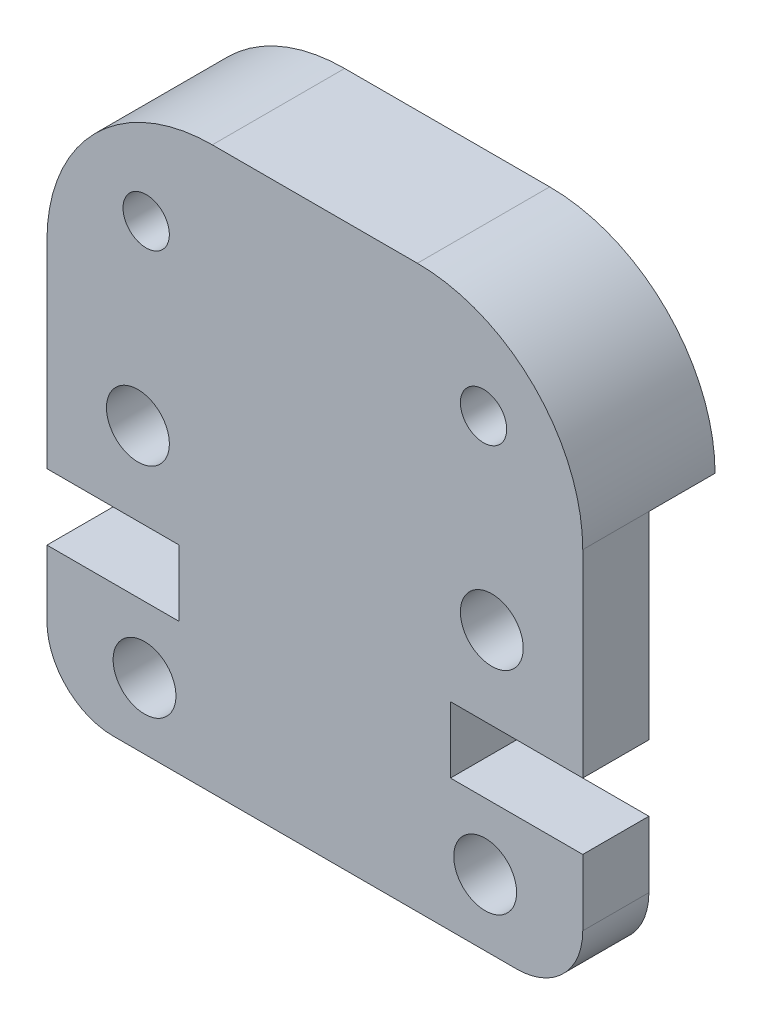
ISO-10303-21;
HEADER;
FILE_DESCRIPTION(('STEP AP214'),'2;1');
FILE_NAME('part.step','',(''),(''),'','','');
FILE_SCHEMA(('AUTOMOTIVE_DESIGN { 1 0 10303 214 1 1 1 1 }'));
ENDSEC;
DATA;
#1=APPLICATION_CONTEXT('core data for automotive mechanical design processes');
#2=APPLICATION_PROTOCOL_DEFINITION('international standard','automotive_design',2000,#1);
#3=PRODUCT_CONTEXT('',#1,'mechanical');
#4=PRODUCT('Part','Part','',(#3));
#5=PRODUCT_RELATED_PRODUCT_CATEGORY('part','',(#4));
#6=PRODUCT_DEFINITION_FORMATION('','',#4);
#7=PRODUCT_DEFINITION_CONTEXT('part definition',#1,'design');
#8=PRODUCT_DEFINITION('design','',#6,#7);
#9=PRODUCT_DEFINITION_SHAPE('','',#8);
#10=(LENGTH_UNIT() NAMED_UNIT(*) SI_UNIT(.MILLI.,.METRE.));
#11=(NAMED_UNIT(*) PLANE_ANGLE_UNIT() SI_UNIT($,.RADIAN.));
#12=(NAMED_UNIT(*) SI_UNIT($,.STERADIAN.) SOLID_ANGLE_UNIT());
#13=UNCERTAINTY_MEASURE_WITH_UNIT(LENGTH_MEASURE(1.E-05),#10,'distance_accuracy_value','');
#14=(GEOMETRIC_REPRESENTATION_CONTEXT(3) GLOBAL_UNCERTAINTY_ASSIGNED_CONTEXT((#13)) GLOBAL_UNIT_ASSIGNED_CONTEXT((#10,
#11,#12)) REPRESENTATION_CONTEXT('',''));
#15=CARTESIAN_POINT('',(0.,0.,0.));
#16=DIRECTION('',(0.,0.,1.));
#17=DIRECTION('',(1.,0.,0.));
#18=AXIS2_PLACEMENT_3D('',#15,#16,#17);
#19=CARTESIAN_POINT('',(-3.09999999999862,11.9799999999986,0.));
#20=DIRECTION('',(0.,0.,-1.));
#21=DIRECTION('',(-1.,0.,0.));
#22=AXIS2_PLACEMENT_3D('',#19,#20,#21);
#23=PLANE('',#22);
#24=CARTESIAN_POINT('',(-5.09999999999842,13.9799999999999,0.));
#25=DIRECTION('',(0.,0.,1.));
#26=DIRECTION('',(-1.,0.,0.));
#27=AXIS2_PLACEMENT_3D('',#24,#25,#26);
#28=CIRCLE('',#27,0.7);
#29=CARTESIAN_POINT('',(-5.79999999999843,13.9799999999999,0.));
#30=VERTEX_POINT('',#29);
#31=EDGE_CURVE('E275',#30,#30,#28,.T.);
#32=ORIENTED_EDGE('',*,*,#31,.T.);
#33=EDGE_LOOP('',(#32));
#34=FACE_BOUND('',#33,.T.);
#35=CARTESIAN_POINT('',(5.09999999999843,13.9799999999999,0.));
#36=DIRECTION('',(0.,0.,1.));
#37=DIRECTION('',(1.,0.,0.));
#38=AXIS2_PLACEMENT_3D('',#35,#36,#37);
#39=CIRCLE('',#38,0.699999999999999);
#40=CARTESIAN_POINT('',(5.79999999999843,13.9799999999999,0.));
#41=VERTEX_POINT('',#40);
#42=EDGE_CURVE('E263',#41,#41,#39,.T.);
#43=ORIENTED_EDGE('',*,*,#42,.T.);
#44=EDGE_LOOP('',(#43));
#45=FACE_BOUND('',#44,.T.);
#46=CARTESIAN_POINT('',(3.09999999999862,11.9799999999986,0.));
#47=DIRECTION('',(0.,0.,1.));
#48=DIRECTION('',(1.,0.,0.));
#49=AXIS2_PLACEMENT_3D('',#46,#47,#48);
#50=CIRCLE('',#49,5.00000000000135);
#51=CARTESIAN_POINT('',(8.09999999999997,11.9799999999986,0.));
#52=VERTEX_POINT('',#51);
#53=CARTESIAN_POINT('',(3.09999999999862,16.98,0.));
#54=VERTEX_POINT('',#53);
#55=EDGE_CURVE('E67',#52,#54,#50,.T.);
#56=ORIENTED_EDGE('',*,*,#55,.F.);
#57=DIRECTION('',(-1.,0.,0.));
#58=VECTOR('',#57,1.);
#59=CARTESIAN_POINT('',(8.09999999999997,11.9799999999986,0.));
#60=LINE('',#59,#58);
#61=CARTESIAN_POINT('',(-8.09999999999997,11.9799999999986,0.));
#62=VERTEX_POINT('',#61);
#63=EDGE_CURVE('E215',#52,#62,#60,.T.);
#64=ORIENTED_EDGE('',*,*,#63,.T.);
#65=CARTESIAN_POINT('',(-3.09999999999862,11.9799999999986,0.));
#66=DIRECTION('',(0.,0.,1.));
#67=DIRECTION('',(-1.,0.,0.));
#68=AXIS2_PLACEMENT_3D('',#65,#66,#67);
#69=CIRCLE('',#68,5.00000000000136);
#70=CARTESIAN_POINT('',(-3.09999999999862,16.98,0.));
#71=VERTEX_POINT('',#70);
#72=EDGE_CURVE('E148',#71,#62,#69,.T.);
#73=ORIENTED_EDGE('',*,*,#72,.F.);
#74=DIRECTION('',(-1.,0.,0.));
#75=VECTOR('',#74,1.);
#76=CARTESIAN_POINT('',(3.09999999999862,16.98,0.));
#77=LINE('',#76,#75);
#78=EDGE_CURVE('E73',#54,#71,#77,.T.);
#79=ORIENTED_EDGE('',*,*,#78,.F.);
#80=EDGE_LOOP('',(#56,#64,#73,#79));
#81=FACE_BOUND('',#80,.T.);
#82=ADVANCED_FACE('F34',(#34,#45,#81),#23,.T.);
#83=CARTESIAN_POINT('',(-3.09999999999862,11.9799999999986,4.));
#84=DIRECTION('',(0.,0.,-1.));
#85=DIRECTION('',(-1.,0.,0.));
#86=AXIS2_PLACEMENT_3D('',#83,#84,#85);
#87=PLANE('',#86);
#88=CARTESIAN_POINT('',(-3.09999999999862,11.9799999999986,4.));
#89=DIRECTION('',(0.,0.,1.));
#90=DIRECTION('',(-1.,0.,0.));
#91=AXIS2_PLACEMENT_3D('',#88,#89,#90);
#92=CIRCLE('',#91,5.00000000000136);
#93=CARTESIAN_POINT('',(-3.09999999999862,16.98,4.));
#94=VERTEX_POINT('',#93);
#95=CARTESIAN_POINT('',(-8.09999999999997,11.9799999999986,4.));
#96=VERTEX_POINT('',#95);
#97=EDGE_CURVE('E154',#94,#96,#92,.T.);
#98=ORIENTED_EDGE('',*,*,#97,.T.);
#99=DIRECTION('',(0.,-1.,0.));
#100=VECTOR('',#99,1.);
#101=CARTESIAN_POINT('',(-8.09999999999997,11.9799999999986,4.));
#102=LINE('',#101,#100);
#103=CARTESIAN_POINT('',(-8.09999999999997,5.99999999999993,4.));
#104=VERTEX_POINT('',#103);
#105=EDGE_CURVE('E81',#96,#104,#102,.T.);
#106=ORIENTED_EDGE('',*,*,#105,.T.);
#107=DIRECTION('',(1.,0.,0.));
#108=VECTOR('',#107,1.);
#109=CARTESIAN_POINT('',(-8.09999999999997,5.99999999999993,4.));
#110=LINE('',#109,#108);
#111=CARTESIAN_POINT('',(-4.10000000000002,5.99999999999993,4.));
#112=VERTEX_POINT('',#111);
#113=EDGE_CURVE('E197',#104,#112,#110,.T.);
#114=ORIENTED_EDGE('',*,*,#113,.T.);
#115=DIRECTION('',(0.,-1.,0.));
#116=VECTOR('',#115,1.);
#117=CARTESIAN_POINT('',(-4.10000000000002,5.99999999999993,4.));
#118=LINE('',#117,#116);
#119=CARTESIAN_POINT('',(-4.10000000000002,3.99999999999995,4.));
#120=VERTEX_POINT('',#119);
#121=EDGE_CURVE('E286',#112,#120,#118,.T.);
#122=ORIENTED_EDGE('',*,*,#121,.T.);
#123=DIRECTION('',(-1.,0.,0.));
#124=VECTOR('',#123,1.);
#125=CARTESIAN_POINT('',(-4.10000000000002,3.99999999999995,4.));
#126=LINE('',#125,#124);
#127=CARTESIAN_POINT('',(-8.09999999999997,3.99999999999995,4.));
#128=VERTEX_POINT('',#127);
#129=EDGE_CURVE('E288',#120,#128,#126,.T.);
#130=ORIENTED_EDGE('',*,*,#129,.T.);
#131=DIRECTION('',(0.,-1.,0.));
#132=VECTOR('',#131,1.);
#133=CARTESIAN_POINT('',(-8.09999999999997,1.99999999999997,4.));
#134=LINE('',#133,#132);
#135=CARTESIAN_POINT('',(-8.09999999999997,1.99999999999997,4.));
#136=VERTEX_POINT('',#135);
#137=EDGE_CURVE('E290',#128,#136,#134,.T.);
#138=ORIENTED_EDGE('',*,*,#137,.T.);
#139=CARTESIAN_POINT('',(-6.1,1.99999999999997,4.));
#140=DIRECTION('',(0.,0.,1.));
#141=DIRECTION('',(-1.,0.,0.));
#142=AXIS2_PLACEMENT_3D('',#139,#140,#141);
#143=CIRCLE('',#142,1.99999999999998);
#144=CARTESIAN_POINT('',(-6.09999999999999,0.,4.));
#145=VERTEX_POINT('',#144);
#146=EDGE_CURVE('E292',#136,#145,#143,.T.);
#147=ORIENTED_EDGE('',*,*,#146,.T.);
#148=DIRECTION('',(1.,0.,0.));
#149=VECTOR('',#148,1.);
#150=CARTESIAN_POINT('',(6.1,0.,4.));
#151=LINE('',#150,#149);
#152=CARTESIAN_POINT('',(6.1,0.,4.));
#153=VERTEX_POINT('',#152);
#154=EDGE_CURVE('E294',#145,#153,#151,.T.);
#155=ORIENTED_EDGE('',*,*,#154,.T.);
#156=CARTESIAN_POINT('',(6.1,1.99999999999998,4.));
#157=DIRECTION('',(0.,0.,1.));
#158=DIRECTION('',(1.,0.,0.));
#159=AXIS2_PLACEMENT_3D('',#156,#157,#158);
#160=CIRCLE('',#159,1.99999999999998);
#161=CARTESIAN_POINT('',(8.09999999999997,1.99999999999998,4.));
#162=VERTEX_POINT('',#161);
#163=EDGE_CURVE('E296',#153,#162,#160,.T.);
#164=ORIENTED_EDGE('',*,*,#163,.T.);
#165=DIRECTION('',(0.,1.,0.));
#166=VECTOR('',#165,1.);
#167=CARTESIAN_POINT('',(8.09999999999997,1.99999999999998,4.));
#168=LINE('',#167,#166);
#169=CARTESIAN_POINT('',(8.09999999999997,3.99999999999995,4.));
#170=VERTEX_POINT('',#169);
#171=EDGE_CURVE('E298',#162,#170,#168,.T.);
#172=ORIENTED_EDGE('',*,*,#171,.T.);
#173=DIRECTION('',(-1.,0.,0.));
#174=VECTOR('',#173,1.);
#175=CARTESIAN_POINT('',(4.10000000000002,3.99999999999995,4.));
#176=LINE('',#175,#174);
#177=CARTESIAN_POINT('',(4.10000000000002,3.99999999999995,4.));
#178=VERTEX_POINT('',#177);
#179=EDGE_CURVE('E300',#170,#178,#176,.T.);
#180=ORIENTED_EDGE('',*,*,#179,.T.);
#181=DIRECTION('',(0.,1.,0.));
#182=VECTOR('',#181,1.);
#183=CARTESIAN_POINT('',(4.10000000000002,5.99999999999993,4.));
#184=LINE('',#183,#182);
#185=CARTESIAN_POINT('',(4.10000000000002,5.99999999999993,4.));
#186=VERTEX_POINT('',#185);
#187=EDGE_CURVE('E302',#178,#186,#184,.T.);
#188=ORIENTED_EDGE('',*,*,#187,.T.);
#189=DIRECTION('',(1.,0.,0.));
#190=VECTOR('',#189,1.);
#191=CARTESIAN_POINT('',(8.09999999999997,5.99999999999993,4.));
#192=LINE('',#191,#190);
#193=CARTESIAN_POINT('',(8.09999999999997,5.99999999999993,4.));
#194=VERTEX_POINT('',#193);
#195=EDGE_CURVE('E127',#186,#194,#192,.T.);
#196=ORIENTED_EDGE('',*,*,#195,.T.);
#197=DIRECTION('',(0.,1.,0.));
#198=VECTOR('',#197,1.);
#199=CARTESIAN_POINT('',(8.09999999999997,11.9799999999986,4.));
#200=LINE('',#199,#198);
#201=CARTESIAN_POINT('',(8.09999999999997,11.9799999999986,4.));
#202=VERTEX_POINT('',#201);
#203=EDGE_CURVE('E120',#194,#202,#200,.T.);
#204=ORIENTED_EDGE('',*,*,#203,.T.);
#205=CARTESIAN_POINT('',(3.09999999999862,11.9799999999986,4.));
#206=DIRECTION('',(0.,0.,1.));
#207=DIRECTION('',(1.,0.,0.));
#208=AXIS2_PLACEMENT_3D('',#205,#206,#207);
#209=CIRCLE('',#208,5.00000000000135);
#210=CARTESIAN_POINT('',(3.09999999999862,16.98,4.));
#211=VERTEX_POINT('',#210);
#212=EDGE_CURVE('E125',#202,#211,#209,.T.);
#213=ORIENTED_EDGE('',*,*,#212,.T.);
#214=DIRECTION('',(-1.,0.,0.));
#215=VECTOR('',#214,1.);
#216=CARTESIAN_POINT('',(3.09999999999862,16.98,4.));
#217=LINE('',#216,#215);
#218=EDGE_CURVE('E52',#211,#94,#217,.T.);
#219=ORIENTED_EDGE('',*,*,#218,.T.);
#220=EDGE_LOOP('',(#98,#106,#114,#122,#130,#138,#147,#155,#164,#172,#180,#188,#196,#204,#213,#219));
#221=FACE_BOUND('',#220,.T.);
#222=CARTESIAN_POINT('',(-5.15,1.99999999999997,4.));
#223=DIRECTION('',(0.,0.,1.));
#224=DIRECTION('',(-1.,0.,0.));
#225=AXIS2_PLACEMENT_3D('',#222,#223,#224);
#226=CIRCLE('',#225,0.95);
#227=CARTESIAN_POINT('',(-6.1,1.99999999999997,4.));
#228=VERTEX_POINT('',#227);
#229=EDGE_CURVE('E151',#228,#228,#226,.T.);
#230=ORIENTED_EDGE('',*,*,#229,.F.);
#231=EDGE_LOOP('',(#230));
#232=FACE_BOUND('',#231,.T.);
#233=CARTESIAN_POINT('',(-5.09999999999842,13.9799999999999,4.));
#234=DIRECTION('',(0.,0.,1.));
#235=DIRECTION('',(-1.,0.,0.));
#236=AXIS2_PLACEMENT_3D('',#233,#234,#235);
#237=CIRCLE('',#236,0.7);
#238=CARTESIAN_POINT('',(-5.79999999999843,13.9799999999999,4.));
#239=VERTEX_POINT('',#238);
#240=EDGE_CURVE('E276',#239,#239,#237,.T.);
#241=ORIENTED_EDGE('',*,*,#240,.F.);
#242=EDGE_LOOP('',(#241));
#243=FACE_BOUND('',#242,.T.);
#244=CARTESIAN_POINT('',(-5.34999999999997,8.50000000000221,4.));
#245=DIRECTION('',(0.,0.,1.));
#246=DIRECTION('',(-1.,0.,0.));
#247=AXIS2_PLACEMENT_3D('',#244,#245,#246);
#248=CIRCLE('',#247,0.95);
#249=CARTESIAN_POINT('',(-6.29999999999997,8.50000000000221,4.));
#250=VERTEX_POINT('',#249);
#251=EDGE_CURVE('E272',#250,#250,#248,.T.);
#252=ORIENTED_EDGE('',*,*,#251,.F.);
#253=EDGE_LOOP('',(#252));
#254=FACE_BOUND('',#253,.T.);
#255=CARTESIAN_POINT('',(5.34999999999998,8.50000000000221,4.));
#256=DIRECTION('',(0.,0.,1.));
#257=DIRECTION('',(1.,0.,0.));
#258=AXIS2_PLACEMENT_3D('',#255,#256,#257);
#259=CIRCLE('',#258,0.95);
#260=CARTESIAN_POINT('',(6.29999999999998,8.50000000000221,4.));
#261=VERTEX_POINT('',#260);
#262=EDGE_CURVE('E267',#261,#261,#259,.T.);
#263=ORIENTED_EDGE('',*,*,#262,.F.);
#264=EDGE_LOOP('',(#263));
#265=FACE_BOUND('',#264,.T.);
#266=CARTESIAN_POINT('',(5.09999999999843,13.9799999999999,4.));
#267=DIRECTION('',(0.,0.,1.));
#268=DIRECTION('',(1.,0.,0.));
#269=AXIS2_PLACEMENT_3D('',#266,#267,#268);
#270=CIRCLE('',#269,0.699999999999999);
#271=CARTESIAN_POINT('',(5.79999999999843,13.9799999999999,4.));
#272=VERTEX_POINT('',#271);
#273=EDGE_CURVE('E264',#272,#272,#270,.T.);
#274=ORIENTED_EDGE('',*,*,#273,.F.);
#275=EDGE_LOOP('',(#274));
#276=FACE_BOUND('',#275,.T.);
#277=CARTESIAN_POINT('',(5.15,1.99999999999998,4.));
#278=DIRECTION('',(0.,0.,1.));
#279=DIRECTION('',(1.,0.,0.));
#280=AXIS2_PLACEMENT_3D('',#277,#278,#279);
#281=CIRCLE('',#280,0.95);
#282=CARTESIAN_POINT('',(6.1,1.99999999999998,4.));
#283=VERTEX_POINT('',#282);
#284=EDGE_CURVE('E260',#283,#283,#281,.T.);
#285=ORIENTED_EDGE('',*,*,#284,.F.);
#286=EDGE_LOOP('',(#285));
#287=FACE_BOUND('',#286,.T.);
#288=ADVANCED_FACE('F122',(#221,#232,#243,#254,#265,#276,#287),#87,.F.);
#289=CARTESIAN_POINT('',(-3.09999999999862,11.9799999999986,4.));
#290=DIRECTION('',(0.,0.,-1.));
#291=DIRECTION('',(-1.,0.,0.));
#292=AXIS2_PLACEMENT_3D('',#289,#290,#291);
#293=CYLINDRICAL_SURFACE('',#292,5.00000000000136);
#294=ORIENTED_EDGE('',*,*,#72,.T.);
#295=DIRECTION('',(0.,0.,-1.));
#296=VECTOR('',#295,1.);
#297=CARTESIAN_POINT('',(-8.09999999999997,11.9799999999986,2.));
#298=LINE('',#297,#296);
#299=CARTESIAN_POINT('',(-8.09999999999997,11.9799999999986,2.));
#300=VERTEX_POINT('',#299);
#301=EDGE_CURVE('E222',#300,#62,#298,.T.);
#302=ORIENTED_EDGE('',*,*,#301,.F.);
#303=DIRECTION('',(0.,0.,-1.));
#304=VECTOR('',#303,1.);
#305=CARTESIAN_POINT('',(-8.09999999999997,11.9799999999986,4.));
#306=LINE('',#305,#304);
#307=EDGE_CURVE('E11',#96,#300,#306,.T.);
#308=ORIENTED_EDGE('',*,*,#307,.F.);
#309=ORIENTED_EDGE('',*,*,#97,.F.);
#310=DIRECTION('',(0.,0.,-1.));
#311=VECTOR('',#310,1.);
#312=CARTESIAN_POINT('',(-3.09999999999862,16.98,4.));
#313=LINE('',#312,#311);
#314=EDGE_CURVE('E144',#94,#71,#313,.T.);
#315=ORIENTED_EDGE('',*,*,#314,.T.);
#316=EDGE_LOOP('',(#294,#302,#308,#309,#315));
#317=FACE_BOUND('',#316,.T.);
#318=ADVANCED_FACE('F36',(#317),#293,.T.);
#319=CARTESIAN_POINT('',(-8.09999999999997,11.9799999999986,4.));
#320=DIRECTION('',(1.,0.,0.));
#321=DIRECTION('',(0.,1.,0.));
#322=AXIS2_PLACEMENT_3D('',#319,#320,#321);
#323=PLANE('',#322);
#324=ORIENTED_EDGE('',*,*,#307,.T.);
#325=DIRECTION('',(0.,-1.,0.));
#326=VECTOR('',#325,1.);
#327=CARTESIAN_POINT('',(-8.09999999999997,11.9799999999986,2.));
#328=LINE('',#327,#326);
#329=CARTESIAN_POINT('',(-8.09999999999997,5.99999999999993,2.));
#330=VERTEX_POINT('',#329);
#331=EDGE_CURVE('E204',#300,#330,#328,.T.);
#332=ORIENTED_EDGE('',*,*,#331,.T.);
#333=DIRECTION('',(0.,0.,-1.));
#334=VECTOR('',#333,1.);
#335=CARTESIAN_POINT('',(-8.09999999999997,5.99999999999993,4.));
#336=LINE('',#335,#334);
#337=EDGE_CURVE('E44',#104,#330,#336,.T.);
#338=ORIENTED_EDGE('',*,*,#337,.F.);
#339=ORIENTED_EDGE('',*,*,#105,.F.);
#340=EDGE_LOOP('',(#324,#332,#338,#339));
#341=FACE_BOUND('',#340,.T.);
#342=ADVANCED_FACE('F202',(#341),#323,.F.);
#343=CARTESIAN_POINT('',(-8.09999999999997,5.99999999999993,4.));
#344=DIRECTION('',(0.,1.,0.));
#345=DIRECTION('',(-1.,0.,0.));
#346=AXIS2_PLACEMENT_3D('',#343,#344,#345);
#347=PLANE('',#346);
#348=ORIENTED_EDGE('',*,*,#337,.T.);
#349=DIRECTION('',(1.,0.,0.));
#350=VECTOR('',#349,1.);
#351=CARTESIAN_POINT('',(-8.09999999999997,5.99999999999993,2.));
#352=LINE('',#351,#350);
#353=CARTESIAN_POINT('',(-4.10000000000002,5.99999999999993,2.));
#354=VERTEX_POINT('',#353);
#355=EDGE_CURVE('E196',#330,#354,#352,.T.);
#356=ORIENTED_EDGE('',*,*,#355,.T.);
#357=DIRECTION('',(0.,0.,-1.));
#358=VECTOR('',#357,1.);
#359=CARTESIAN_POINT('',(-4.10000000000002,5.99999999999993,4.));
#360=LINE('',#359,#358);
#361=EDGE_CURVE('E185',#112,#354,#360,.T.);
#362=ORIENTED_EDGE('',*,*,#361,.F.);
#363=ORIENTED_EDGE('',*,*,#113,.F.);
#364=EDGE_LOOP('',(#348,#356,#362,#363));
#365=FACE_BOUND('',#364,.T.);
#366=ADVANCED_FACE('F193',(#365),#347,.F.);
#367=CARTESIAN_POINT('',(-4.10000000000002,5.99999999999993,4.));
#368=DIRECTION('',(1.,0.,0.));
#369=DIRECTION('',(0.,0.,-1.));
#370=AXIS2_PLACEMENT_3D('',#367,#368,#369);
#371=PLANE('',#370);
#372=ORIENTED_EDGE('',*,*,#361,.T.);
#373=DIRECTION('',(0.,-1.,0.));
#374=VECTOR('',#373,1.);
#375=CARTESIAN_POINT('',(-4.10000000000002,5.99999999999993,2.));
#376=LINE('',#375,#374);
#377=CARTESIAN_POINT('',(-4.10000000000002,3.99999999999995,2.));
#378=VERTEX_POINT('',#377);
#379=EDGE_CURVE('E256',#354,#378,#376,.T.);
#380=ORIENTED_EDGE('',*,*,#379,.T.);
#381=DIRECTION('',(0.,0.,-1.));
#382=VECTOR('',#381,1.);
#383=CARTESIAN_POINT('',(-4.10000000000002,3.99999999999995,4.));
#384=LINE('',#383,#382);
#385=EDGE_CURVE('E182',#120,#378,#384,.T.);
#386=ORIENTED_EDGE('',*,*,#385,.F.);
#387=ORIENTED_EDGE('',*,*,#121,.F.);
#388=EDGE_LOOP('',(#372,#380,#386,#387));
#389=FACE_BOUND('',#388,.T.);
#390=ADVANCED_FACE('F331',(#389),#371,.F.);
#391=CARTESIAN_POINT('',(-4.10000000000002,3.99999999999995,4.));
#392=DIRECTION('',(0.,-1.,0.));
#393=DIRECTION('',(1.,0.,0.));
#394=AXIS2_PLACEMENT_3D('',#391,#392,#393);
#395=PLANE('',#394);
#396=ORIENTED_EDGE('',*,*,#385,.T.);
#397=DIRECTION('',(-1.,0.,0.));
#398=VECTOR('',#397,1.);
#399=CARTESIAN_POINT('',(-4.10000000000002,3.99999999999995,2.));
#400=LINE('',#399,#398);
#401=CARTESIAN_POINT('',(-8.09999999999997,3.99999999999995,2.));
#402=VERTEX_POINT('',#401);
#403=EDGE_CURVE('E253',#378,#402,#400,.T.);
#404=ORIENTED_EDGE('',*,*,#403,.T.);
#405=DIRECTION('',(0.,0.,-1.));
#406=VECTOR('',#405,1.);
#407=CARTESIAN_POINT('',(-8.09999999999997,3.99999999999995,4.));
#408=LINE('',#407,#406);
#409=EDGE_CURVE('E179',#128,#402,#408,.T.);
#410=ORIENTED_EDGE('',*,*,#409,.F.);
#411=ORIENTED_EDGE('',*,*,#129,.F.);
#412=EDGE_LOOP('',(#396,#404,#410,#411));
#413=FACE_BOUND('',#412,.T.);
#414=ADVANCED_FACE('F335',(#413),#395,.F.);
#415=CARTESIAN_POINT('',(-8.09999999999997,1.99999999999997,4.));
#416=DIRECTION('',(1.,0.,0.));
#417=DIRECTION('',(0.,0.,-1.));
#418=AXIS2_PLACEMENT_3D('',#415,#416,#417);
#419=PLANE('',#418);
#420=ORIENTED_EDGE('',*,*,#409,.T.);
#421=CARTESIAN_POINT('',(-8.09999999999997,1.99999999999997,2.));
#422=VERTEX_POINT('',#421);
#423=EDGE_CURVE('E210',#402,#422,#328,.T.);
#424=ORIENTED_EDGE('',*,*,#423,.T.);
#425=DIRECTION('',(0.,0.,-1.));
#426=VECTOR('',#425,1.);
#427=CARTESIAN_POINT('',(-8.09999999999997,1.99999999999997,4.));
#428=LINE('',#427,#426);
#429=EDGE_CURVE('E176',#136,#422,#428,.T.);
#430=ORIENTED_EDGE('',*,*,#429,.F.);
#431=ORIENTED_EDGE('',*,*,#137,.F.);
#432=EDGE_LOOP('',(#420,#424,#430,#431));
#433=FACE_BOUND('',#432,.T.);
#434=ADVANCED_FACE('F390',(#433),#419,.F.);
#435=CARTESIAN_POINT('',(-6.1,1.99999999999997,4.));
#436=DIRECTION('',(0.,0.,-1.));
#437=DIRECTION('',(-1.,0.,0.));
#438=AXIS2_PLACEMENT_3D('',#435,#436,#437);
#439=CYLINDRICAL_SURFACE('',#438,1.99999999999998);
#440=ORIENTED_EDGE('',*,*,#429,.T.);
#441=CARTESIAN_POINT('',(-6.1,1.99999999999997,2.));
#442=DIRECTION('',(0.,0.,1.));
#443=DIRECTION('',(1.,0.,0.));
#444=AXIS2_PLACEMENT_3D('',#441,#442,#443);
#445=CIRCLE('',#444,1.99999999999998);
#446=CARTESIAN_POINT('',(-6.09999999999999,0.,2.));
#447=VERTEX_POINT('',#446);
#448=EDGE_CURVE('E250',#422,#447,#445,.T.);
#449=ORIENTED_EDGE('',*,*,#448,.T.);
#450=DIRECTION('',(0.,0.,-1.));
#451=VECTOR('',#450,1.);
#452=CARTESIAN_POINT('',(-6.09999999999999,0.,4.));
#453=LINE('',#452,#451);
#454=EDGE_CURVE('E173',#145,#447,#453,.T.);
#455=ORIENTED_EDGE('',*,*,#454,.F.);
#456=ORIENTED_EDGE('',*,*,#146,.F.);
#457=EDGE_LOOP('',(#440,#449,#455,#456));
#458=FACE_BOUND('',#457,.T.);
#459=ADVANCED_FACE('F386',(#458),#439,.T.);
#460=CARTESIAN_POINT('',(6.1,0.,4.));
#461=DIRECTION('',(0.,1.,0.));
#462=DIRECTION('',(-1.,0.,0.));
#463=AXIS2_PLACEMENT_3D('',#460,#461,#462);
#464=PLANE('',#463);
#465=ORIENTED_EDGE('',*,*,#454,.T.);
#466=DIRECTION('',(1.,0.,0.));
#467=VECTOR('',#466,1.);
#468=CARTESIAN_POINT('',(-8.09999999999997,0.,2.));
#469=LINE('',#468,#467);
#470=CARTESIAN_POINT('',(6.1,0.,2.));
#471=VERTEX_POINT('',#470);
#472=EDGE_CURVE('E209',#447,#471,#469,.T.);
#473=ORIENTED_EDGE('',*,*,#472,.T.);
#474=DIRECTION('',(0.,0.,-1.));
#475=VECTOR('',#474,1.);
#476=CARTESIAN_POINT('',(6.1,0.,4.));
#477=LINE('',#476,#475);
#478=EDGE_CURVE('E170',#153,#471,#477,.T.);
#479=ORIENTED_EDGE('',*,*,#478,.F.);
#480=ORIENTED_EDGE('',*,*,#154,.F.);
#481=EDGE_LOOP('',(#465,#473,#479,#480));
#482=FACE_BOUND('',#481,.T.);
#483=ADVANCED_FACE('F382',(#482),#464,.F.);
#484=CARTESIAN_POINT('',(6.1,1.99999999999998,4.));
#485=DIRECTION('',(0.,0.,-1.));
#486=DIRECTION('',(-1.,0.,0.));
#487=AXIS2_PLACEMENT_3D('',#484,#485,#486);
#488=CYLINDRICAL_SURFACE('',#487,1.99999999999998);
#489=ORIENTED_EDGE('',*,*,#478,.T.);
#490=CARTESIAN_POINT('',(6.1,1.99999999999998,2.));
#491=DIRECTION('',(0.,0.,1.));
#492=DIRECTION('',(1.,0.,0.));
#493=AXIS2_PLACEMENT_3D('',#490,#491,#492);
#494=CIRCLE('',#493,1.99999999999998);
#495=CARTESIAN_POINT('',(8.09999999999997,1.99999999999998,2.));
#496=VERTEX_POINT('',#495);
#497=EDGE_CURVE('E247',#471,#496,#494,.T.);
#498=ORIENTED_EDGE('',*,*,#497,.T.);
#499=DIRECTION('',(0.,0.,-1.));
#500=VECTOR('',#499,1.);
#501=CARTESIAN_POINT('',(8.09999999999997,1.99999999999998,4.));
#502=LINE('',#501,#500);
#503=EDGE_CURVE('E167',#162,#496,#502,.T.);
#504=ORIENTED_EDGE('',*,*,#503,.F.);
#505=ORIENTED_EDGE('',*,*,#163,.F.);
#506=EDGE_LOOP('',(#489,#498,#504,#505));
#507=FACE_BOUND('',#506,.T.);
#508=ADVANCED_FACE('F378',(#507),#488,.T.);
#509=CARTESIAN_POINT('',(8.09999999999997,1.99999999999998,4.));
#510=DIRECTION('',(-1.,0.,0.));
#511=DIRECTION('',(0.,0.,1.));
#512=AXIS2_PLACEMENT_3D('',#509,#510,#511);
#513=PLANE('',#512);
#514=ORIENTED_EDGE('',*,*,#503,.T.);
#515=DIRECTION('',(0.,1.,0.));
#516=VECTOR('',#515,1.);
#517=CARTESIAN_POINT('',(8.09999999999997,0.,2.));
#518=LINE('',#517,#516);
#519=CARTESIAN_POINT('',(8.09999999999997,3.99999999999995,2.));
#520=VERTEX_POINT('',#519);
#521=EDGE_CURVE('E218',#496,#520,#518,.T.);
#522=ORIENTED_EDGE('',*,*,#521,.T.);
#523=DIRECTION('',(0.,0.,-1.));
#524=VECTOR('',#523,1.);
#525=CARTESIAN_POINT('',(8.09999999999997,3.99999999999995,4.));
#526=LINE('',#525,#524);
#527=EDGE_CURVE('E164',#170,#520,#526,.T.);
#528=ORIENTED_EDGE('',*,*,#527,.F.);
#529=ORIENTED_EDGE('',*,*,#171,.F.);
#530=EDGE_LOOP('',(#514,#522,#528,#529));
#531=FACE_BOUND('',#530,.T.);
#532=ADVANCED_FACE('F374',(#531),#513,.F.);
#533=CARTESIAN_POINT('',(4.10000000000002,3.99999999999995,4.));
#534=DIRECTION('',(0.,-1.,0.));
#535=DIRECTION('',(0.,0.,-1.));
#536=AXIS2_PLACEMENT_3D('',#533,#534,#535);
#537=PLANE('',#536);
#538=ORIENTED_EDGE('',*,*,#527,.T.);
#539=DIRECTION('',(-1.,0.,0.));
#540=VECTOR('',#539,1.);
#541=CARTESIAN_POINT('',(4.10000000000002,3.99999999999995,2.));
#542=LINE('',#541,#540);
#543=CARTESIAN_POINT('',(4.10000000000002,3.99999999999995,2.));
#544=VERTEX_POINT('',#543);
#545=EDGE_CURVE('E244',#520,#544,#542,.T.);
#546=ORIENTED_EDGE('',*,*,#545,.T.);
#547=DIRECTION('',(0.,0.,-1.));
#548=VECTOR('',#547,1.);
#549=CARTESIAN_POINT('',(4.10000000000002,3.99999999999995,4.));
#550=LINE('',#549,#548);
#551=EDGE_CURVE('E161',#178,#544,#550,.T.);
#552=ORIENTED_EDGE('',*,*,#551,.F.);
#553=ORIENTED_EDGE('',*,*,#179,.F.);
#554=EDGE_LOOP('',(#538,#546,#552,#553));
#555=FACE_BOUND('',#554,.T.);
#556=ADVANCED_FACE('F371',(#555),#537,.F.);
#557=CARTESIAN_POINT('',(4.10000000000002,5.99999999999993,4.));
#558=DIRECTION('',(-1.,0.,0.));
#559=DIRECTION('',(0.,0.,1.));
#560=AXIS2_PLACEMENT_3D('',#557,#558,#559);
#561=PLANE('',#560);
#562=ORIENTED_EDGE('',*,*,#551,.T.);
#563=DIRECTION('',(0.,1.,0.));
#564=VECTOR('',#563,1.);
#565=CARTESIAN_POINT('',(4.10000000000002,5.99999999999993,2.));
#566=LINE('',#565,#564);
#567=CARTESIAN_POINT('',(4.10000000000002,5.99999999999993,2.));
#568=VERTEX_POINT('',#567);
#569=EDGE_CURVE('E241',#544,#568,#566,.T.);
#570=ORIENTED_EDGE('',*,*,#569,.T.);
#571=DIRECTION('',(0.,0.,-1.));
#572=VECTOR('',#571,1.);
#573=CARTESIAN_POINT('',(4.10000000000002,5.99999999999993,4.));
#574=LINE('',#573,#572);
#575=EDGE_CURVE('E158',#186,#568,#574,.T.);
#576=ORIENTED_EDGE('',*,*,#575,.F.);
#577=ORIENTED_EDGE('',*,*,#187,.F.);
#578=EDGE_LOOP('',(#562,#570,#576,#577));
#579=FACE_BOUND('',#578,.T.);
#580=ADVANCED_FACE('F308',(#579),#561,.F.);
#581=CARTESIAN_POINT('',(8.09999999999997,5.99999999999993,4.));
#582=DIRECTION('',(0.,1.,0.));
#583=DIRECTION('',(0.,0.,1.));
#584=AXIS2_PLACEMENT_3D('',#581,#582,#583);
#585=PLANE('',#584);
#586=ORIENTED_EDGE('',*,*,#575,.T.);
#587=DIRECTION('',(1.,0.,0.));
#588=VECTOR('',#587,1.);
#589=CARTESIAN_POINT('',(8.09999999999997,5.99999999999993,2.));
#590=LINE('',#589,#588);
#591=CARTESIAN_POINT('',(8.09999999999997,5.99999999999993,2.));
#592=VERTEX_POINT('',#591);
#593=EDGE_CURVE('E238',#568,#592,#590,.T.);
#594=ORIENTED_EDGE('',*,*,#593,.T.);
#595=DIRECTION('',(0.,0.,-1.));
#596=VECTOR('',#595,1.);
#597=CARTESIAN_POINT('',(8.09999999999997,5.99999999999993,4.));
#598=LINE('',#597,#596);
#599=EDGE_CURVE('E139',#194,#592,#598,.T.);
#600=ORIENTED_EDGE('',*,*,#599,.F.);
#601=ORIENTED_EDGE('',*,*,#195,.F.);
#602=EDGE_LOOP('',(#586,#594,#600,#601));
#603=FACE_BOUND('',#602,.T.);
#604=ADVANCED_FACE('F312',(#603),#585,.F.);
#605=CARTESIAN_POINT('',(8.09999999999997,11.9799999999986,4.));
#606=DIRECTION('',(-1.,0.,0.));
#607=DIRECTION('',(0.,0.,1.));
#608=AXIS2_PLACEMENT_3D('',#605,#606,#607);
#609=PLANE('',#608);
#610=ORIENTED_EDGE('',*,*,#599,.T.);
#611=CARTESIAN_POINT('',(8.09999999999997,11.9799999999986,2.));
#612=VERTEX_POINT('',#611);
#613=EDGE_CURVE('E138',#592,#612,#518,.T.);
#614=ORIENTED_EDGE('',*,*,#613,.T.);
#615=DIRECTION('',(0.,0.,-1.));
#616=VECTOR('',#615,1.);
#617=CARTESIAN_POINT('',(8.09999999999997,11.9799999999986,4.));
#618=LINE('',#617,#616);
#619=EDGE_CURVE('E134',#202,#612,#618,.T.);
#620=ORIENTED_EDGE('',*,*,#619,.F.);
#621=ORIENTED_EDGE('',*,*,#203,.F.);
#622=EDGE_LOOP('',(#610,#614,#620,#621));
#623=FACE_BOUND('',#622,.T.);
#624=ADVANCED_FACE('F135',(#623),#609,.F.);
#625=CARTESIAN_POINT('',(3.09999999999862,11.9799999999986,4.));
#626=DIRECTION('',(0.,0.,-1.));
#627=DIRECTION('',(-1.,0.,0.));
#628=AXIS2_PLACEMENT_3D('',#625,#626,#627);
#629=CYLINDRICAL_SURFACE('',#628,5.00000000000135);
#630=ORIENTED_EDGE('',*,*,#55,.T.);
#631=DIRECTION('',(0.,0.,-1.));
#632=VECTOR('',#631,1.);
#633=CARTESIAN_POINT('',(3.09999999999862,16.98,4.));
#634=LINE('',#633,#632);
#635=EDGE_CURVE('E140',#211,#54,#634,.T.);
#636=ORIENTED_EDGE('',*,*,#635,.F.);
#637=ORIENTED_EDGE('',*,*,#212,.F.);
#638=ORIENTED_EDGE('',*,*,#619,.T.);
#639=DIRECTION('',(0.,0.,-1.));
#640=VECTOR('',#639,1.);
#641=CARTESIAN_POINT('',(8.09999999999997,11.9799999999986,2.));
#642=LINE('',#641,#640);
#643=EDGE_CURVE('E227',#612,#52,#642,.T.);
#644=ORIENTED_EDGE('',*,*,#643,.T.);
#645=EDGE_LOOP('',(#630,#636,#637,#638,#644));
#646=FACE_BOUND('',#645,.T.);
#647=ADVANCED_FACE('F142',(#646),#629,.T.);
#648=CARTESIAN_POINT('',(3.09999999999862,16.98,4.));
#649=DIRECTION('',(0.,-1.,0.));
#650=DIRECTION('',(0.,0.,-1.));
#651=AXIS2_PLACEMENT_3D('',#648,#649,#650);
#652=PLANE('',#651);
#653=ORIENTED_EDGE('',*,*,#78,.T.);
#654=ORIENTED_EDGE('',*,*,#314,.F.);
#655=ORIENTED_EDGE('',*,*,#218,.F.);
#656=ORIENTED_EDGE('',*,*,#635,.T.);
#657=EDGE_LOOP('',(#653,#654,#655,#656));
#658=FACE_BOUND('',#657,.T.);
#659=ADVANCED_FACE('F359',(#658),#652,.F.);
#660=CARTESIAN_POINT('',(-5.15,1.99999999999997,4.));
#661=DIRECTION('',(0.,0.,-1.));
#662=DIRECTION('',(-1.,0.,0.));
#663=AXIS2_PLACEMENT_3D('',#660,#661,#662);
#664=CYLINDRICAL_SURFACE('',#663,0.95);
#665=CARTESIAN_POINT('',(-5.15,1.99999999999997,2.));
#666=DIRECTION('',(0.,0.,1.));
#667=DIRECTION('',(1.,0.,0.));
#668=AXIS2_PLACEMENT_3D('',#665,#666,#667);
#669=CIRCLE('',#668,0.95);
#670=CARTESIAN_POINT('',(-4.2,1.99999999999997,2.));
#671=VERTEX_POINT('',#670);
#672=EDGE_CURVE('E235',#671,#671,#669,.T.);
#673=ORIENTED_EDGE('',*,*,#672,.F.);
#674=EDGE_LOOP('',(#673));
#675=FACE_BOUND('',#674,.T.);
#676=ORIENTED_EDGE('',*,*,#229,.T.);
#677=EDGE_LOOP('',(#676));
#678=FACE_BOUND('',#677,.T.);
#679=ADVANCED_FACE('F362',(#675,#678),#664,.F.);
#680=CARTESIAN_POINT('',(-5.09999999999842,13.9799999999999,4.));
#681=DIRECTION('',(0.,0.,-1.));
#682=DIRECTION('',(-1.,0.,0.));
#683=AXIS2_PLACEMENT_3D('',#680,#681,#682);
#684=CYLINDRICAL_SURFACE('',#683,0.7);
#685=ORIENTED_EDGE('',*,*,#240,.T.);
#686=EDGE_LOOP('',(#685));
#687=FACE_BOUND('',#686,.T.);
#688=ORIENTED_EDGE('',*,*,#31,.F.);
#689=EDGE_LOOP('',(#688));
#690=FACE_BOUND('',#689,.T.);
#691=ADVANCED_FACE('F424',(#687,#690),#684,.F.);
#692=CARTESIAN_POINT('',(-5.34999999999997,8.50000000000221,4.));
#693=DIRECTION('',(0.,0.,-1.));
#694=DIRECTION('',(-1.,0.,0.));
#695=AXIS2_PLACEMENT_3D('',#692,#693,#694);
#696=CYLINDRICAL_SURFACE('',#695,0.95);
#697=CARTESIAN_POINT('',(-5.34999999999997,8.50000000000221,2.));
#698=DIRECTION('',(0.,0.,1.));
#699=DIRECTION('',(1.,0.,0.));
#700=AXIS2_PLACEMENT_3D('',#697,#698,#699);
#701=CIRCLE('',#700,0.95);
#702=CARTESIAN_POINT('',(-4.39999999999997,8.50000000000221,2.));
#703=VERTEX_POINT('',#702);
#704=EDGE_CURVE('E232',#703,#703,#701,.T.);
#705=ORIENTED_EDGE('',*,*,#704,.F.);
#706=EDGE_LOOP('',(#705));
#707=FACE_BOUND('',#706,.T.);
#708=ORIENTED_EDGE('',*,*,#251,.T.);
#709=EDGE_LOOP('',(#708));
#710=FACE_BOUND('',#709,.T.);
#711=ADVANCED_FACE('F429',(#707,#710),#696,.F.);
#712=CARTESIAN_POINT('',(5.34999999999998,8.50000000000221,4.));
#713=DIRECTION('',(0.,0.,-1.));
#714=DIRECTION('',(-1.,0.,0.));
#715=AXIS2_PLACEMENT_3D('',#712,#713,#714);
#716=CYLINDRICAL_SURFACE('',#715,0.95);
#717=CARTESIAN_POINT('',(5.34999999999998,8.50000000000221,2.));
#718=DIRECTION('',(0.,0.,1.));
#719=DIRECTION('',(1.,0.,0.));
#720=AXIS2_PLACEMENT_3D('',#717,#718,#719);
#721=CIRCLE('',#720,0.95);
#722=CARTESIAN_POINT('',(6.29999999999998,8.50000000000221,2.));
#723=VERTEX_POINT('',#722);
#724=EDGE_CURVE('E229',#723,#723,#721,.T.);
#725=ORIENTED_EDGE('',*,*,#724,.F.);
#726=EDGE_LOOP('',(#725));
#727=FACE_BOUND('',#726,.T.);
#728=ORIENTED_EDGE('',*,*,#262,.T.);
#729=EDGE_LOOP('',(#728));
#730=FACE_BOUND('',#729,.T.);
#731=ADVANCED_FACE('F442',(#727,#730),#716,.F.);
#732=CARTESIAN_POINT('',(5.09999999999843,13.9799999999999,4.));
#733=DIRECTION('',(0.,0.,-1.));
#734=DIRECTION('',(-1.,0.,0.));
#735=AXIS2_PLACEMENT_3D('',#732,#733,#734);
#736=CYLINDRICAL_SURFACE('',#735,0.699999999999999);
#737=ORIENTED_EDGE('',*,*,#273,.T.);
#738=EDGE_LOOP('',(#737));
#739=FACE_BOUND('',#738,.T.);
#740=ORIENTED_EDGE('',*,*,#42,.F.);
#741=EDGE_LOOP('',(#740));
#742=FACE_BOUND('',#741,.T.);
#743=ADVANCED_FACE('F437',(#739,#742),#736,.F.);
#744=CARTESIAN_POINT('',(5.15,1.99999999999998,4.));
#745=DIRECTION('',(0.,0.,-1.));
#746=DIRECTION('',(-1.,0.,0.));
#747=AXIS2_PLACEMENT_3D('',#744,#745,#746);
#748=CYLINDRICAL_SURFACE('',#747,0.95);
#749=CARTESIAN_POINT('',(5.15,1.99999999999998,2.));
#750=DIRECTION('',(0.,0.,1.));
#751=DIRECTION('',(1.,0.,0.));
#752=AXIS2_PLACEMENT_3D('',#749,#750,#751);
#753=CIRCLE('',#752,0.95);
#754=CARTESIAN_POINT('',(6.1,1.99999999999998,2.));
#755=VERTEX_POINT('',#754);
#756=EDGE_CURVE('E38',#755,#755,#753,.T.);
#757=ORIENTED_EDGE('',*,*,#756,.F.);
#758=EDGE_LOOP('',(#757));
#759=FACE_BOUND('',#758,.T.);
#760=ORIENTED_EDGE('',*,*,#284,.T.);
#761=EDGE_LOOP('',(#760));
#762=FACE_BOUND('',#761,.T.);
#763=ADVANCED_FACE('F441',(#759,#762),#748,.F.);
#764=CARTESIAN_POINT('',(0.,0.,2.));
#765=DIRECTION('',(0.,0.,1.));
#766=DIRECTION('',(1.,0.,0.));
#767=AXIS2_PLACEMENT_3D('',#764,#765,#766);
#768=PLANE('',#767);
#769=ORIENTED_EDGE('',*,*,#672,.T.);
#770=EDGE_LOOP('',(#769));
#771=FACE_BOUND('',#770,.T.);
#772=ORIENTED_EDGE('',*,*,#704,.T.);
#773=EDGE_LOOP('',(#772));
#774=FACE_BOUND('',#773,.T.);
#775=ORIENTED_EDGE('',*,*,#724,.T.);
#776=EDGE_LOOP('',(#775));
#777=FACE_BOUND('',#776,.T.);
#778=ORIENTED_EDGE('',*,*,#756,.T.);
#779=EDGE_LOOP('',(#778));
#780=FACE_BOUND('',#779,.T.);
#781=ORIENTED_EDGE('',*,*,#331,.F.);
#782=DIRECTION('',(-1.,0.,0.));
#783=VECTOR('',#782,1.);
#784=CARTESIAN_POINT('',(8.09999999999997,11.9799999999986,2.));
#785=LINE('',#784,#783);
#786=EDGE_CURVE('E219',#612,#300,#785,.T.);
#787=ORIENTED_EDGE('',*,*,#786,.F.);
#788=ORIENTED_EDGE('',*,*,#613,.F.);
#789=ORIENTED_EDGE('',*,*,#593,.F.);
#790=ORIENTED_EDGE('',*,*,#569,.F.);
#791=ORIENTED_EDGE('',*,*,#545,.F.);
#792=ORIENTED_EDGE('',*,*,#521,.F.);
#793=ORIENTED_EDGE('',*,*,#497,.F.);
#794=ORIENTED_EDGE('',*,*,#472,.F.);
#795=ORIENTED_EDGE('',*,*,#448,.F.);
#796=ORIENTED_EDGE('',*,*,#423,.F.);
#797=ORIENTED_EDGE('',*,*,#403,.F.);
#798=ORIENTED_EDGE('',*,*,#379,.F.);
#799=ORIENTED_EDGE('',*,*,#355,.F.);
#800=EDGE_LOOP('',(#781,#787,#788,#789,#790,#791,#792,#793,#794,#795,#796,#797,#798,#799));
#801=FACE_BOUND('',#800,.T.);
#802=ADVANCED_FACE('F328',(#771,#774,#777,#780,#801),#768,.F.);
#803=CARTESIAN_POINT('',(8.09999999999997,11.9799999999986,2.));
#804=DIRECTION('',(0.,-1.,0.));
#805=DIRECTION('',(1.,0.,0.));
#806=AXIS2_PLACEMENT_3D('',#803,#804,#805);
#807=PLANE('',#806);
#808=ORIENTED_EDGE('',*,*,#63,.F.);
#809=ORIENTED_EDGE('',*,*,#643,.F.);
#810=ORIENTED_EDGE('',*,*,#786,.T.);
#811=ORIENTED_EDGE('',*,*,#301,.T.);
#812=EDGE_LOOP('',(#808,#809,#810,#811));
#813=FACE_BOUND('',#812,.T.);
#814=ADVANCED_FACE('F345',(#813),#807,.T.);
#815=CLOSED_SHELL('',(#82,#288,#318,#342,#366,#390,#414,#434,#459,#483,#508,#532,#556,#580,#604,
#624,#647,#659,#679,#691,#711,#731,#743,#763,#802,#814));
#816=MANIFOLD_SOLID_BREP('B2',#815);
#817=ADVANCED_BREP_SHAPE_REPRESENTATION('',(#18,#816),#14);
#818=SHAPE_DEFINITION_REPRESENTATION(#9,#817);
ENDSEC;
END-ISO-10303-21;
